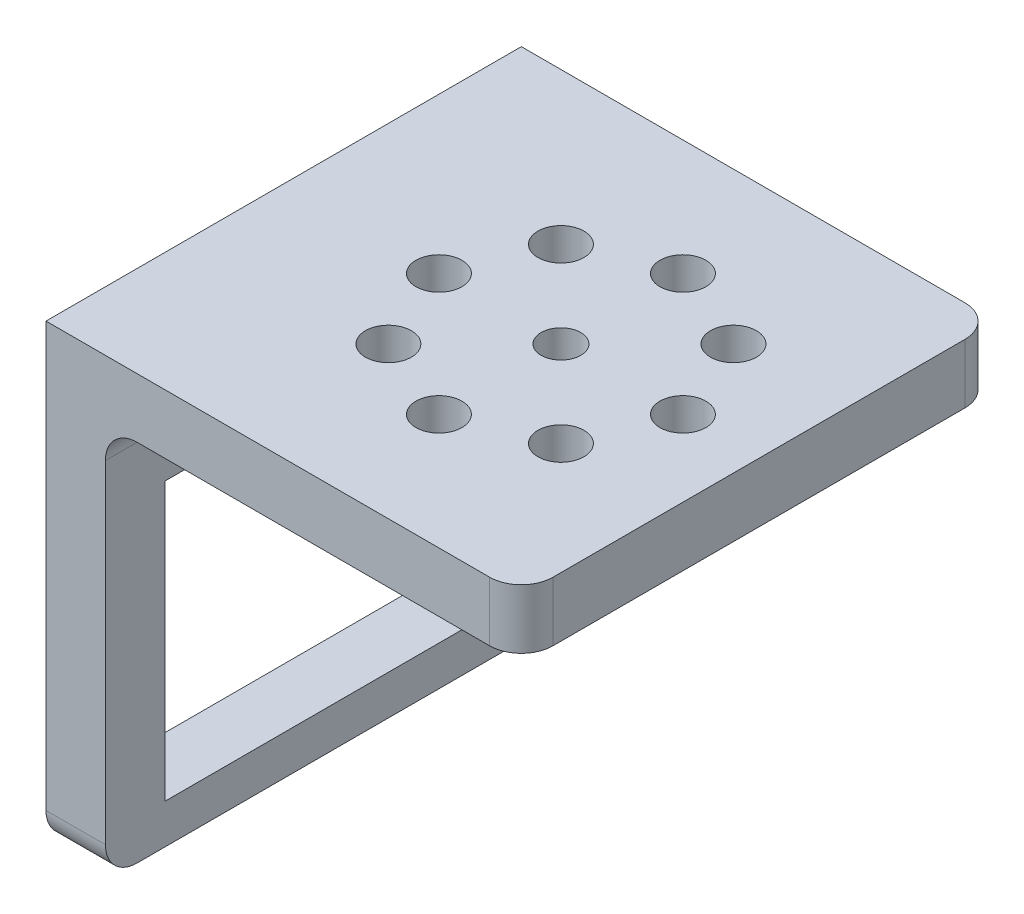
ISO-10303-21;
HEADER;
FILE_DESCRIPTION(('STEP AP214'),'2;1');
FILE_NAME('part.step','',(''),(''),'','','');
FILE_SCHEMA(('AUTOMOTIVE_DESIGN { 1 0 10303 214 1 1 1 1 }'));
ENDSEC;
DATA;
#1=APPLICATION_CONTEXT('core data for automotive mechanical design processes');
#2=APPLICATION_PROTOCOL_DEFINITION('international standard','automotive_design',2000,#1);
#3=PRODUCT_CONTEXT('',#1,'mechanical');
#4=PRODUCT('Part','Part','',(#3));
#5=PRODUCT_RELATED_PRODUCT_CATEGORY('part','',(#4));
#6=PRODUCT_DEFINITION_FORMATION('','',#4);
#7=PRODUCT_DEFINITION_CONTEXT('part definition',#1,'design');
#8=PRODUCT_DEFINITION('design','',#6,#7);
#9=PRODUCT_DEFINITION_SHAPE('','',#8);
#10=(LENGTH_UNIT() NAMED_UNIT(*) SI_UNIT(.MILLI.,.METRE.));
#11=(NAMED_UNIT(*) PLANE_ANGLE_UNIT() SI_UNIT($,.RADIAN.));
#12=(NAMED_UNIT(*) SI_UNIT($,.STERADIAN.) SOLID_ANGLE_UNIT());
#13=UNCERTAINTY_MEASURE_WITH_UNIT(LENGTH_MEASURE(1.E-05),#10,'distance_accuracy_value','');
#14=(GEOMETRIC_REPRESENTATION_CONTEXT(3) GLOBAL_UNCERTAINTY_ASSIGNED_CONTEXT((#13)) GLOBAL_UNIT_ASSIGNED_CONTEXT((#10,
#11,#12)) REPRESENTATION_CONTEXT('',''));
#15=CARTESIAN_POINT('',(0.,0.,0.));
#16=DIRECTION('',(0.,0.,1.));
#17=DIRECTION('',(1.,0.,0.));
#18=AXIS2_PLACEMENT_3D('',#15,#16,#17);
#19=CARTESIAN_POINT('',(-4.7625,0.,38.1));
#20=DIRECTION('',(0.,1.,0.));
#21=DIRECTION('',(0.,0.,1.));
#22=AXIS2_PLACEMENT_3D('',#19,#20,#21);
#23=PLANE('',#22);
#24=DIRECTION('',(0.,0.,-1.));
#25=VECTOR('',#24,1.);
#26=CARTESIAN_POINT('',(0.,0.,38.1));
#27=LINE('',#26,#25);
#28=CARTESIAN_POINT('',(0.,0.,35.56));
#29=VERTEX_POINT('',#28);
#30=CARTESIAN_POINT('',(0.,0.,2.54000000000001));
#31=VERTEX_POINT('',#30);
#32=EDGE_CURVE('E215',#29,#31,#27,.T.);
#33=ORIENTED_EDGE('',*,*,#32,.F.);
#34=DIRECTION('',(1.,0.,0.));
#35=VECTOR('',#34,1.);
#36=CARTESIAN_POINT('',(-4.7625,0.,35.56));
#37=LINE('',#36,#35);
#38=CARTESIAN_POINT('',(-4.7625,0.,35.56));
#39=VERTEX_POINT('',#38);
#40=EDGE_CURVE('E56',#29,#39,#37,.F.);
#41=ORIENTED_EDGE('',*,*,#40,.T.);
#42=DIRECTION('',(0.,0.,-1.));
#43=VECTOR('',#42,1.);
#44=CARTESIAN_POINT('',(-4.7625,0.,38.1));
#45=LINE('',#44,#43);
#46=CARTESIAN_POINT('',(-4.7625,0.,2.54000000000001));
#47=VERTEX_POINT('',#46);
#48=EDGE_CURVE('E197',#39,#47,#45,.T.);
#49=ORIENTED_EDGE('',*,*,#48,.T.);
#50=DIRECTION('',(1.,0.,0.));
#51=VECTOR('',#50,1.);
#52=CARTESIAN_POINT('',(-4.7625,0.,2.54));
#53=LINE('',#52,#51);
#54=EDGE_CURVE('E256',#47,#31,#53,.T.);
#55=ORIENTED_EDGE('',*,*,#54,.T.);
#56=EDGE_LOOP('',(#33,#41,#49,#55));
#57=FACE_BOUND('',#56,.T.);
#58=ADVANCED_FACE('F35',(#57),#23,.F.);
#59=CARTESIAN_POINT('',(0.,0.,38.1));
#60=DIRECTION('',(-1.,0.,0.));
#61=DIRECTION('',(0.,0.,1.));
#62=AXIS2_PLACEMENT_3D('',#59,#60,#61);
#63=PLANE('',#62);
#64=DIRECTION('',(0.,0.,-1.));
#65=VECTOR('',#64,1.);
#66=CARTESIAN_POINT('',(0.,25.4,38.1));
#67=LINE('',#66,#65);
#68=CARTESIAN_POINT('',(0.,25.4,33.3375));
#69=VERTEX_POINT('',#68);
#70=CARTESIAN_POINT('',(0.,25.4,4.7625));
#71=VERTEX_POINT('',#70);
#72=EDGE_CURVE('E179',#69,#71,#67,.T.);
#73=ORIENTED_EDGE('',*,*,#72,.T.);
#74=DIRECTION('',(0.,-1.,0.));
#75=VECTOR('',#74,1.);
#76=CARTESIAN_POINT('',(0.,0.,4.76250000000001));
#77=LINE('',#76,#75);
#78=CARTESIAN_POINT('',(0.,3.175,4.76250000000001));
#79=VERTEX_POINT('',#78);
#80=EDGE_CURVE('E182',#71,#79,#77,.T.);
#81=ORIENTED_EDGE('',*,*,#80,.T.);
#82=DIRECTION('',(0.,0.,1.));
#83=VECTOR('',#82,1.);
#84=CARTESIAN_POINT('',(0.,3.175,38.1));
#85=LINE('',#84,#83);
#86=CARTESIAN_POINT('',(0.,3.175,33.3375));
#87=VERTEX_POINT('',#86);
#88=EDGE_CURVE('E174',#79,#87,#85,.T.);
#89=ORIENTED_EDGE('',*,*,#88,.T.);
#90=DIRECTION('',(0.,1.,0.));
#91=VECTOR('',#90,1.);
#92=CARTESIAN_POINT('',(0.,0.,33.3375));
#93=LINE('',#92,#91);
#94=EDGE_CURVE('E150',#87,#69,#93,.T.);
#95=ORIENTED_EDGE('',*,*,#94,.T.);
#96=EDGE_LOOP('',(#73,#81,#89,#95));
#97=FACE_BOUND('',#96,.T.);
#98=DIRECTION('',(0.,1.,0.));
#99=VECTOR('',#98,1.);
#100=CARTESIAN_POINT('',(0.,0.,38.1));
#101=LINE('',#100,#99);
#102=CARTESIAN_POINT('',(0.,2.54,38.1));
#103=VERTEX_POINT('',#102);
#104=CARTESIAN_POINT('',(0.,29.21,38.1));
#105=VERTEX_POINT('',#104);
#106=EDGE_CURVE('E186',#103,#105,#101,.T.);
#107=ORIENTED_EDGE('',*,*,#106,.F.);
#108=CARTESIAN_POINT('',(0.,2.54,35.56));
#109=DIRECTION('',(-1.,0.,0.));
#110=DIRECTION('',(0.,0.,1.));
#111=AXIS2_PLACEMENT_3D('',#108,#109,#110);
#112=CIRCLE('',#111,2.54);
#113=EDGE_CURVE('E254',#103,#29,#112,.F.);
#114=ORIENTED_EDGE('',*,*,#113,.T.);
#115=ORIENTED_EDGE('',*,*,#32,.T.);
#116=CARTESIAN_POINT('',(0.,2.54,2.54));
#117=DIRECTION('',(-1.,0.,0.));
#118=DIRECTION('',(0.,0.,1.));
#119=AXIS2_PLACEMENT_3D('',#116,#117,#118);
#120=CIRCLE('',#119,2.54);
#121=CARTESIAN_POINT('',(0.,2.54,0.));
#122=VERTEX_POINT('',#121);
#123=EDGE_CURVE('E252',#31,#122,#120,.F.);
#124=ORIENTED_EDGE('',*,*,#123,.T.);
#125=DIRECTION('',(0.,1.,0.));
#126=VECTOR('',#125,1.);
#127=CARTESIAN_POINT('',(0.,0.,0.));
#128=LINE('',#127,#126);
#129=CARTESIAN_POINT('',(0.,29.21,0.));
#130=VERTEX_POINT('',#129);
#131=EDGE_CURVE('E185',#122,#130,#128,.T.);
#132=ORIENTED_EDGE('',*,*,#131,.T.);
#133=DIRECTION('',(0.,0.,-1.));
#134=VECTOR('',#133,1.);
#135=CARTESIAN_POINT('',(0.,29.21,38.1));
#136=LINE('',#135,#134);
#137=EDGE_CURVE('E221',#130,#105,#136,.F.);
#138=ORIENTED_EDGE('',*,*,#137,.T.);
#139=EDGE_LOOP('',(#107,#114,#115,#124,#132,#138));
#140=FACE_BOUND('',#139,.T.);
#141=ADVANCED_FACE('F263',(#97,#140),#63,.F.);
#142=CARTESIAN_POINT('',(0.,31.75,38.1));
#143=DIRECTION('',(0.,1.,0.));
#144=DIRECTION('',(0.,0.,1.));
#145=AXIS2_PLACEMENT_3D('',#142,#143,#144);
#146=PLANE('',#145);
#147=CARTESIAN_POINT('',(17.4625,31.75,9.271));
#148=DIRECTION('',(0.,1.,0.));
#149=DIRECTION('',(0.,0.,1.));
#150=AXIS2_PLACEMENT_3D('',#147,#148,#149);
#151=CIRCLE('',#150,1.8415);
#152=CARTESIAN_POINT('',(17.4625,31.75,11.1125));
#153=VERTEX_POINT('',#152);
#154=EDGE_CURVE('E344',#153,#153,#151,.T.);
#155=ORIENTED_EDGE('',*,*,#154,.T.);
#156=EDGE_LOOP('',(#155));
#157=FACE_BOUND('',#156,.T.);
#158=CARTESIAN_POINT('',(10.5477027867767,31.75,12.1352027867768));
#159=DIRECTION('',(0.,1.,0.));
#160=DIRECTION('',(0.,0.,1.));
#161=AXIS2_PLACEMENT_3D('',#158,#159,#160);
#162=CIRCLE('',#161,1.8415);
#163=CARTESIAN_POINT('',(10.5477027867767,31.75,13.9767027867768));
#164=VERTEX_POINT('',#163);
#165=EDGE_CURVE('E348',#164,#164,#162,.T.);
#166=ORIENTED_EDGE('',*,*,#165,.T.);
#167=EDGE_LOOP('',(#166));
#168=FACE_BOUND('',#167,.T.);
#169=CARTESIAN_POINT('',(7.6835,31.75,19.05));
#170=DIRECTION('',(0.,1.,0.));
#171=DIRECTION('',(0.,0.,1.));
#172=AXIS2_PLACEMENT_3D('',#169,#170,#171);
#173=CIRCLE('',#172,1.8415);
#174=CARTESIAN_POINT('',(7.6835,31.75,20.8915));
#175=VERTEX_POINT('',#174);
#176=EDGE_CURVE('E352',#175,#175,#173,.T.);
#177=ORIENTED_EDGE('',*,*,#176,.T.);
#178=EDGE_LOOP('',(#177));
#179=FACE_BOUND('',#178,.T.);
#180=CARTESIAN_POINT('',(10.5477027867768,31.75,25.9647972132233));
#181=DIRECTION('',(0.,1.,0.));
#182=DIRECTION('',(0.,0.,1.));
#183=AXIS2_PLACEMENT_3D('',#180,#181,#182);
#184=CIRCLE('',#183,1.8415);
#185=CARTESIAN_POINT('',(10.5477027867768,31.75,27.8062972132233));
#186=VERTEX_POINT('',#185);
#187=EDGE_CURVE('E356',#186,#186,#184,.T.);
#188=ORIENTED_EDGE('',*,*,#187,.T.);
#189=EDGE_LOOP('',(#188));
#190=FACE_BOUND('',#189,.T.);
#191=CARTESIAN_POINT('',(17.4625000000001,31.75,28.829));
#192=DIRECTION('',(0.,1.,0.));
#193=DIRECTION('',(0.,0.,1.));
#194=AXIS2_PLACEMENT_3D('',#191,#192,#193);
#195=CIRCLE('',#194,1.8415);
#196=CARTESIAN_POINT('',(17.4625000000001,31.75,30.6705));
#197=VERTEX_POINT('',#196);
#198=EDGE_CURVE('E360',#197,#197,#195,.T.);
#199=ORIENTED_EDGE('',*,*,#198,.T.);
#200=EDGE_LOOP('',(#199));
#201=FACE_BOUND('',#200,.T.);
#202=CARTESIAN_POINT('',(24.3772972132233,31.75,25.9647972132232));
#203=DIRECTION('',(0.,1.,0.));
#204=DIRECTION('',(0.,0.,1.));
#205=AXIS2_PLACEMENT_3D('',#202,#203,#204);
#206=CIRCLE('',#205,1.8415);
#207=CARTESIAN_POINT('',(24.3772972132233,31.75,27.8062972132232));
#208=VERTEX_POINT('',#207);
#209=EDGE_CURVE('E364',#208,#208,#206,.T.);
#210=ORIENTED_EDGE('',*,*,#209,.T.);
#211=EDGE_LOOP('',(#210));
#212=FACE_BOUND('',#211,.T.);
#213=CARTESIAN_POINT('',(24.3772972132232,31.75,12.1352027867767));
#214=DIRECTION('',(0.,1.,0.));
#215=DIRECTION('',(0.,0.,1.));
#216=AXIS2_PLACEMENT_3D('',#213,#214,#215);
#217=CIRCLE('',#216,1.8415);
#218=CARTESIAN_POINT('',(24.3772972132232,31.75,13.9767027867767));
#219=VERTEX_POINT('',#218);
#220=EDGE_CURVE('E368',#219,#219,#217,.T.);
#221=ORIENTED_EDGE('',*,*,#220,.T.);
#222=EDGE_LOOP('',(#221));
#223=FACE_BOUND('',#222,.T.);
#224=CARTESIAN_POINT('',(27.2415,31.75,19.05));
#225=DIRECTION('',(0.,1.,0.));
#226=DIRECTION('',(0.,0.,1.));
#227=AXIS2_PLACEMENT_3D('',#224,#225,#226);
#228=CIRCLE('',#227,1.8415);
#229=CARTESIAN_POINT('',(27.2415,31.75,20.8915));
#230=VERTEX_POINT('',#229);
#231=EDGE_CURVE('E372',#230,#230,#228,.T.);
#232=ORIENTED_EDGE('',*,*,#231,.T.);
#233=EDGE_LOOP('',(#232));
#234=FACE_BOUND('',#233,.T.);
#235=CARTESIAN_POINT('',(17.4625,31.75,19.05));
#236=DIRECTION('',(0.,1.,0.));
#237=DIRECTION('',(0.,0.,1.));
#238=AXIS2_PLACEMENT_3D('',#235,#236,#237);
#239=CIRCLE('',#238,1.5875);
#240=CARTESIAN_POINT('',(17.4625,31.75,20.6375));
#241=VERTEX_POINT('',#240);
#242=EDGE_CURVE('E375',#241,#241,#239,.T.);
#243=ORIENTED_EDGE('',*,*,#242,.T.);
#244=EDGE_LOOP('',(#243));
#245=FACE_BOUND('',#244,.T.);
#246=DIRECTION('',(1.,0.,0.));
#247=VECTOR('',#246,1.);
#248=CARTESIAN_POINT('',(0.,31.75,0.));
#249=LINE('',#248,#247);
#250=CARTESIAN_POINT('',(2.54,31.75,0.));
#251=VERTEX_POINT('',#250);
#252=CARTESIAN_POINT('',(30.7975,31.75,0.));
#253=VERTEX_POINT('',#252);
#254=EDGE_CURVE('E199',#251,#253,#249,.T.);
#255=ORIENTED_EDGE('',*,*,#254,.T.);
#256=CARTESIAN_POINT('',(30.7975,31.75,2.54));
#257=DIRECTION('',(0.,1.,0.));
#258=DIRECTION('',(0.,0.,1.));
#259=AXIS2_PLACEMENT_3D('',#256,#257,#258);
#260=CIRCLE('',#259,2.54);
#261=CARTESIAN_POINT('',(33.3375,31.75,2.54000000000001));
#262=VERTEX_POINT('',#261);
#263=EDGE_CURVE('E244',#253,#262,#260,.F.);
#264=ORIENTED_EDGE('',*,*,#263,.T.);
#265=DIRECTION('',(0.,0.,-1.));
#266=VECTOR('',#265,1.);
#267=CARTESIAN_POINT('',(33.3375,31.75,38.1));
#268=LINE('',#267,#266);
#269=CARTESIAN_POINT('',(33.3375,31.75,35.56));
#270=VERTEX_POINT('',#269);
#271=EDGE_CURVE('E212',#270,#262,#268,.T.);
#272=ORIENTED_EDGE('',*,*,#271,.F.);
#273=CARTESIAN_POINT('',(30.7975,31.75,35.56));
#274=DIRECTION('',(0.,1.,0.));
#275=DIRECTION('',(0.,0.,1.));
#276=AXIS2_PLACEMENT_3D('',#273,#274,#275);
#277=CIRCLE('',#276,2.54);
#278=CARTESIAN_POINT('',(30.7975,31.75,38.1));
#279=VERTEX_POINT('',#278);
#280=EDGE_CURVE('E242',#270,#279,#277,.F.);
#281=ORIENTED_EDGE('',*,*,#280,.T.);
#282=DIRECTION('',(1.,0.,0.));
#283=VECTOR('',#282,1.);
#284=CARTESIAN_POINT('',(0.,31.75,38.1));
#285=LINE('',#284,#283);
#286=CARTESIAN_POINT('',(2.54,31.75,38.1));
#287=VERTEX_POINT('',#286);
#288=EDGE_CURVE('E188',#287,#279,#285,.T.);
#289=ORIENTED_EDGE('',*,*,#288,.F.);
#290=DIRECTION('',(0.,0.,-1.));
#291=VECTOR('',#290,1.);
#292=CARTESIAN_POINT('',(2.54,31.75,0.));
#293=LINE('',#292,#291);
#294=EDGE_CURVE('E218',#287,#251,#293,.T.);
#295=ORIENTED_EDGE('',*,*,#294,.T.);
#296=EDGE_LOOP('',(#255,#264,#272,#281,#289,#295));
#297=FACE_BOUND('',#296,.T.);
#298=ADVANCED_FACE('F291',(#157,#168,#179,#190,#201,#212,#223,#234,#245,#297),#146,.F.);
#299=CARTESIAN_POINT('',(33.3375,31.75,38.1));
#300=DIRECTION('',(-1.,0.,0.));
#301=DIRECTION('',(0.,0.,1.));
#302=AXIS2_PLACEMENT_3D('',#299,#300,#301);
#303=PLANE('',#302);
#304=ORIENTED_EDGE('',*,*,#271,.T.);
#305=DIRECTION('',(0.,1.,0.));
#306=VECTOR('',#305,1.);
#307=CARTESIAN_POINT('',(33.3375,31.75,2.54));
#308=LINE('',#307,#306);
#309=CARTESIAN_POINT('',(33.3375,36.5125,2.54000000000001));
#310=VERTEX_POINT('',#309);
#311=EDGE_CURVE('E231',#262,#310,#308,.T.);
#312=ORIENTED_EDGE('',*,*,#311,.T.);
#313=DIRECTION('',(0.,0.,-1.));
#314=VECTOR('',#313,1.);
#315=CARTESIAN_POINT('',(33.3375,36.5125,38.1));
#316=LINE('',#315,#314);
#317=CARTESIAN_POINT('',(33.3375,36.5125,35.56));
#318=VERTEX_POINT('',#317);
#319=EDGE_CURVE('E209',#318,#310,#316,.T.);
#320=ORIENTED_EDGE('',*,*,#319,.F.);
#321=DIRECTION('',(0.,1.,0.));
#322=VECTOR('',#321,1.);
#323=CARTESIAN_POINT('',(33.3375,31.75,35.56));
#324=LINE('',#323,#322);
#325=EDGE_CURVE('E229',#318,#270,#324,.F.);
#326=ORIENTED_EDGE('',*,*,#325,.T.);
#327=EDGE_LOOP('',(#304,#312,#320,#326));
#328=FACE_BOUND('',#327,.T.);
#329=ADVANCED_FACE('F322',(#328),#303,.F.);
#330=CARTESIAN_POINT('',(33.3375,36.5125,38.1));
#331=DIRECTION('',(0.,-1.,0.));
#332=DIRECTION('',(1.,0.,0.));
#333=AXIS2_PLACEMENT_3D('',#330,#331,#332);
#334=PLANE('',#333);
#335=CARTESIAN_POINT('',(17.4625,36.5125,9.271));
#336=DIRECTION('',(0.,1.,0.));
#337=DIRECTION('',(0.,0.,1.));
#338=AXIS2_PLACEMENT_3D('',#335,#336,#337);
#339=CIRCLE('',#338,1.8415);
#340=CARTESIAN_POINT('',(17.4625,36.5125,11.1125));
#341=VERTEX_POINT('',#340);
#342=EDGE_CURVE('E396',#341,#341,#339,.T.);
#343=ORIENTED_EDGE('',*,*,#342,.F.);
#344=EDGE_LOOP('',(#343));
#345=FACE_BOUND('',#344,.T.);
#346=CARTESIAN_POINT('',(10.5477027867767,36.5125,12.1352027867768));
#347=DIRECTION('',(0.,1.,0.));
#348=DIRECTION('',(0.707106781186551,0.,0.707106781186544));
#349=AXIS2_PLACEMENT_3D('',#346,#347,#348);
#350=CIRCLE('',#349,1.8415);
#351=CARTESIAN_POINT('',(11.8498399243317,36.5125,13.4373399243318));
#352=VERTEX_POINT('',#351);
#353=EDGE_CURVE('E404',#352,#352,#350,.T.);
#354=ORIENTED_EDGE('',*,*,#353,.F.);
#355=EDGE_LOOP('',(#354));
#356=FACE_BOUND('',#355,.T.);
#357=CARTESIAN_POINT('',(7.6835,36.5125,19.05));
#358=DIRECTION('',(0.,1.,0.));
#359=DIRECTION('',(1.,0.,0.));
#360=AXIS2_PLACEMENT_3D('',#357,#358,#359);
#361=CIRCLE('',#360,1.8415);
#362=CARTESIAN_POINT('',(9.525,36.5125,19.05));
#363=VERTEX_POINT('',#362);
#364=EDGE_CURVE('E400',#363,#363,#361,.T.);
#365=ORIENTED_EDGE('',*,*,#364,.F.);
#366=EDGE_LOOP('',(#365));
#367=FACE_BOUND('',#366,.T.);
#368=CARTESIAN_POINT('',(10.5477027867768,36.5125,25.9647972132233));
#369=DIRECTION('',(0.,1.,0.));
#370=DIRECTION('',(0.707106781186541,0.,-0.707106781186554));
#371=AXIS2_PLACEMENT_3D('',#368,#369,#370);
#372=CIRCLE('',#371,1.8415);
#373=CARTESIAN_POINT('',(11.8498399243318,36.5125,24.6626600756683));
#374=VERTEX_POINT('',#373);
#375=EDGE_CURVE('E397',#374,#374,#372,.T.);
#376=ORIENTED_EDGE('',*,*,#375,.F.);
#377=EDGE_LOOP('',(#376));
#378=FACE_BOUND('',#377,.T.);
#379=CARTESIAN_POINT('',(17.4625000000001,36.5125,28.829));
#380=DIRECTION('',(0.,1.,0.));
#381=DIRECTION('',(0.,0.,-1.));
#382=AXIS2_PLACEMENT_3D('',#379,#380,#381);
#383=CIRCLE('',#382,1.8415);
#384=CARTESIAN_POINT('',(17.4625000000001,36.5125,26.9875));
#385=VERTEX_POINT('',#384);
#386=EDGE_CURVE('E401',#385,#385,#383,.T.);
#387=ORIENTED_EDGE('',*,*,#386,.F.);
#388=EDGE_LOOP('',(#387));
#389=FACE_BOUND('',#388,.T.);
#390=CARTESIAN_POINT('',(24.3772972132233,36.5125,25.9647972132232));
#391=DIRECTION('',(0.,1.,0.));
#392=DIRECTION('',(-0.707106781186556,0.,-0.707106781186539));
#393=AXIS2_PLACEMENT_3D('',#390,#391,#392);
#394=CIRCLE('',#393,1.8415);
#395=CARTESIAN_POINT('',(23.0751600756683,36.5125,24.6626600756682));
#396=VERTEX_POINT('',#395);
#397=EDGE_CURVE('E409',#396,#396,#394,.T.);
#398=ORIENTED_EDGE('',*,*,#397,.F.);
#399=EDGE_LOOP('',(#398));
#400=FACE_BOUND('',#399,.T.);
#401=CARTESIAN_POINT('',(24.3772972132232,36.5125,12.1352027867767));
#402=DIRECTION('',(0.,1.,0.));
#403=DIRECTION('',(-0.707106781186546,0.,0.707106781186549));
#404=AXIS2_PLACEMENT_3D('',#401,#402,#403);
#405=CIRCLE('',#404,1.8415);
#406=CARTESIAN_POINT('',(23.0751600756682,36.5125,13.4373399243318));
#407=VERTEX_POINT('',#406);
#408=EDGE_CURVE('E393',#407,#407,#405,.T.);
#409=ORIENTED_EDGE('',*,*,#408,.F.);
#410=EDGE_LOOP('',(#409));
#411=FACE_BOUND('',#410,.T.);
#412=CARTESIAN_POINT('',(27.2415,36.5125,19.05));
#413=DIRECTION('',(0.,1.,0.));
#414=DIRECTION('',(-1.,0.,0.));
#415=AXIS2_PLACEMENT_3D('',#412,#413,#414);
#416=CIRCLE('',#415,1.8415);
#417=CARTESIAN_POINT('',(25.4,36.5125,19.05));
#418=VERTEX_POINT('',#417);
#419=EDGE_CURVE('E383',#418,#418,#416,.T.);
#420=ORIENTED_EDGE('',*,*,#419,.F.);
#421=EDGE_LOOP('',(#420));
#422=FACE_BOUND('',#421,.T.);
#423=CARTESIAN_POINT('',(17.4625,36.5125,19.05));
#424=DIRECTION('',(0.,1.,0.));
#425=DIRECTION('',(-1.,0.,0.));
#426=AXIS2_PLACEMENT_3D('',#423,#424,#425);
#427=CIRCLE('',#426,1.5875);
#428=CARTESIAN_POINT('',(15.875,36.5125,19.05));
#429=VERTEX_POINT('',#428);
#430=EDGE_CURVE('E377',#429,#429,#427,.T.);
#431=ORIENTED_EDGE('',*,*,#430,.F.);
#432=EDGE_LOOP('',(#431));
#433=FACE_BOUND('',#432,.T.);
#434=ORIENTED_EDGE('',*,*,#319,.T.);
#435=CARTESIAN_POINT('',(30.7975,36.5125,2.54));
#436=DIRECTION('',(0.,-1.,0.));
#437=DIRECTION('',(1.,0.,0.));
#438=AXIS2_PLACEMENT_3D('',#435,#436,#437);
#439=CIRCLE('',#438,2.54);
#440=CARTESIAN_POINT('',(30.7975,36.5125,0.));
#441=VERTEX_POINT('',#440);
#442=EDGE_CURVE('E236',#310,#441,#439,.F.);
#443=ORIENTED_EDGE('',*,*,#442,.T.);
#444=DIRECTION('',(-1.,0.,0.));
#445=VECTOR('',#444,1.);
#446=CARTESIAN_POINT('',(33.3375,36.5125,0.));
#447=LINE('',#446,#445);
#448=CARTESIAN_POINT('',(-4.7625,36.5125,0.));
#449=VERTEX_POINT('',#448);
#450=EDGE_CURVE('E202',#441,#449,#447,.T.);
#451=ORIENTED_EDGE('',*,*,#450,.T.);
#452=DIRECTION('',(0.,0.,-1.));
#453=VECTOR('',#452,1.);
#454=CARTESIAN_POINT('',(-4.7625,36.5125,38.1));
#455=LINE('',#454,#453);
#456=CARTESIAN_POINT('',(-4.7625,36.5125,38.1));
#457=VERTEX_POINT('',#456);
#458=EDGE_CURVE('E206',#457,#449,#455,.T.);
#459=ORIENTED_EDGE('',*,*,#458,.F.);
#460=DIRECTION('',(-1.,0.,0.));
#461=VECTOR('',#460,1.);
#462=CARTESIAN_POINT('',(33.3375,36.5125,38.1));
#463=LINE('',#462,#461);
#464=CARTESIAN_POINT('',(30.7975,36.5125,38.1));
#465=VERTEX_POINT('',#464);
#466=EDGE_CURVE('E192',#465,#457,#463,.T.);
#467=ORIENTED_EDGE('',*,*,#466,.F.);
#468=CARTESIAN_POINT('',(30.7975,36.5125,35.56));
#469=DIRECTION('',(0.,-1.,0.));
#470=DIRECTION('',(1.,0.,0.));
#471=AXIS2_PLACEMENT_3D('',#468,#469,#470);
#472=CIRCLE('',#471,2.54);
#473=EDGE_CURVE('E234',#465,#318,#472,.F.);
#474=ORIENTED_EDGE('',*,*,#473,.T.);
#475=EDGE_LOOP('',(#434,#443,#451,#459,#467,#474));
#476=FACE_BOUND('',#475,.T.);
#477=ADVANCED_FACE('F324',(#345,#356,#367,#378,#389,#400,#411,#422,#433,#476),#334,.F.);
#478=CARTESIAN_POINT('',(-4.7625,36.5125,38.1));
#479=DIRECTION('',(1.,0.,0.));
#480=DIRECTION('',(0.,1.,0.));
#481=AXIS2_PLACEMENT_3D('',#478,#479,#480);
#482=PLANE('',#481);
#483=DIRECTION('',(0.,0.,1.));
#484=VECTOR('',#483,1.);
#485=CARTESIAN_POINT('',(-4.7625,3.175,4.76250000000001));
#486=LINE('',#485,#484);
#487=CARTESIAN_POINT('',(-4.7625,3.175,4.76250000000001));
#488=VERTEX_POINT('',#487);
#489=CARTESIAN_POINT('',(-4.7625,3.175,33.3375));
#490=VERTEX_POINT('',#489);
#491=EDGE_CURVE('E158',#488,#490,#486,.T.);
#492=ORIENTED_EDGE('',*,*,#491,.F.);
#493=DIRECTION('',(0.,-1.,0.));
#494=VECTOR('',#493,1.);
#495=CARTESIAN_POINT('',(-4.7625,25.4,4.7625));
#496=LINE('',#495,#494);
#497=CARTESIAN_POINT('',(-4.7625,25.4,4.7625));
#498=VERTEX_POINT('',#497);
#499=EDGE_CURVE('E163',#498,#488,#496,.T.);
#500=ORIENTED_EDGE('',*,*,#499,.F.);
#501=DIRECTION('',(0.,0.,-1.));
#502=VECTOR('',#501,1.);
#503=CARTESIAN_POINT('',(-4.7625,25.4,4.7625));
#504=LINE('',#503,#502);
#505=CARTESIAN_POINT('',(-4.7625,25.4,33.3375));
#506=VERTEX_POINT('',#505);
#507=EDGE_CURVE('E167',#506,#498,#504,.T.);
#508=ORIENTED_EDGE('',*,*,#507,.F.);
#509=DIRECTION('',(0.,1.,0.));
#510=VECTOR('',#509,1.);
#511=CARTESIAN_POINT('',(-4.7625,25.4,33.3375));
#512=LINE('',#511,#510);
#513=EDGE_CURVE('E147',#490,#506,#512,.T.);
#514=ORIENTED_EDGE('',*,*,#513,.F.);
#515=EDGE_LOOP('',(#492,#500,#508,#514));
#516=FACE_BOUND('',#515,.T.);
#517=ORIENTED_EDGE('',*,*,#48,.F.);
#518=CARTESIAN_POINT('',(-4.7625,2.54,35.56));
#519=DIRECTION('',(1.,0.,0.));
#520=DIRECTION('',(0.,1.,0.));
#521=AXIS2_PLACEMENT_3D('',#518,#519,#520);
#522=CIRCLE('',#521,2.54);
#523=CARTESIAN_POINT('',(-4.7625,2.54,38.1));
#524=VERTEX_POINT('',#523);
#525=EDGE_CURVE('E11',#39,#524,#522,.F.);
#526=ORIENTED_EDGE('',*,*,#525,.T.);
#527=DIRECTION('',(0.,-1.,0.));
#528=VECTOR('',#527,1.);
#529=CARTESIAN_POINT('',(-4.7625,36.5125,38.1));
#530=LINE('',#529,#528);
#531=EDGE_CURVE('E194',#457,#524,#530,.T.);
#532=ORIENTED_EDGE('',*,*,#531,.F.);
#533=ORIENTED_EDGE('',*,*,#458,.T.);
#534=DIRECTION('',(0.,-1.,0.));
#535=VECTOR('',#534,1.);
#536=CARTESIAN_POINT('',(-4.7625,36.5125,0.));
#537=LINE('',#536,#535);
#538=CARTESIAN_POINT('',(-4.7625,2.54,0.));
#539=VERTEX_POINT('',#538);
#540=EDGE_CURVE('E189',#449,#539,#537,.T.);
#541=ORIENTED_EDGE('',*,*,#540,.T.);
#542=CARTESIAN_POINT('',(-4.7625,2.54,2.54));
#543=DIRECTION('',(1.,0.,0.));
#544=DIRECTION('',(0.,1.,0.));
#545=AXIS2_PLACEMENT_3D('',#542,#543,#544);
#546=CIRCLE('',#545,2.54);
#547=EDGE_CURVE('E43',#539,#47,#546,.F.);
#548=ORIENTED_EDGE('',*,*,#547,.T.);
#549=EDGE_LOOP('',(#517,#526,#532,#533,#541,#548));
#550=FACE_BOUND('',#549,.T.);
#551=ADVANCED_FACE('F165',(#516,#550),#482,.F.);
#552=CARTESIAN_POINT('',(0.,0.,38.1));
#553=DIRECTION('',(0.,0.,1.));
#554=DIRECTION('',(1.,0.,0.));
#555=AXIS2_PLACEMENT_3D('',#552,#553,#554);
#556=PLANE('',#555);
#557=ORIENTED_EDGE('',*,*,#288,.T.);
#558=DIRECTION('',(0.,1.,0.));
#559=VECTOR('',#558,1.);
#560=CARTESIAN_POINT('',(30.7975,36.5125,38.1));
#561=LINE('',#560,#559);
#562=EDGE_CURVE('E249',#279,#465,#561,.T.);
#563=ORIENTED_EDGE('',*,*,#562,.T.);
#564=ORIENTED_EDGE('',*,*,#466,.T.);
#565=ORIENTED_EDGE('',*,*,#531,.T.);
#566=DIRECTION('',(1.,0.,0.));
#567=VECTOR('',#566,1.);
#568=CARTESIAN_POINT('',(0.,2.54,38.1));
#569=LINE('',#568,#567);
#570=EDGE_CURVE('E246',#524,#103,#569,.T.);
#571=ORIENTED_EDGE('',*,*,#570,.T.);
#572=ORIENTED_EDGE('',*,*,#106,.T.);
#573=CARTESIAN_POINT('',(2.54,29.21,38.1));
#574=DIRECTION('',(0.,0.,1.));
#575=DIRECTION('',(1.,0.,0.));
#576=AXIS2_PLACEMENT_3D('',#573,#574,#575);
#577=CIRCLE('',#576,2.54);
#578=EDGE_CURVE('E227',#105,#287,#577,.F.);
#579=ORIENTED_EDGE('',*,*,#578,.T.);
#580=EDGE_LOOP('',(#557,#563,#564,#565,#571,#572,#579));
#581=FACE_BOUND('',#580,.T.);
#582=ADVANCED_FACE('F270',(#581),#556,.T.);
#583=CARTESIAN_POINT('',(0.,0.,0.));
#584=DIRECTION('',(0.,0.,1.));
#585=DIRECTION('',(1.,0.,0.));
#586=AXIS2_PLACEMENT_3D('',#583,#584,#585);
#587=PLANE('',#586);
#588=ORIENTED_EDGE('',*,*,#450,.F.);
#589=DIRECTION('',(0.,1.,0.));
#590=VECTOR('',#589,1.);
#591=CARTESIAN_POINT('',(30.7975,0.,0.));
#592=LINE('',#591,#590);
#593=EDGE_CURVE('E240',#441,#253,#592,.F.);
#594=ORIENTED_EDGE('',*,*,#593,.T.);
#595=ORIENTED_EDGE('',*,*,#254,.F.);
#596=CARTESIAN_POINT('',(2.54,29.21,0.));
#597=DIRECTION('',(0.,0.,1.));
#598=DIRECTION('',(1.,0.,0.));
#599=AXIS2_PLACEMENT_3D('',#596,#597,#598);
#600=CIRCLE('',#599,2.54);
#601=EDGE_CURVE('E224',#251,#130,#600,.T.);
#602=ORIENTED_EDGE('',*,*,#601,.T.);
#603=ORIENTED_EDGE('',*,*,#131,.F.);
#604=DIRECTION('',(1.,0.,0.));
#605=VECTOR('',#604,1.);
#606=CARTESIAN_POINT('',(0.,2.54,0.));
#607=LINE('',#606,#605);
#608=EDGE_CURVE('E238',#122,#539,#607,.F.);
#609=ORIENTED_EDGE('',*,*,#608,.T.);
#610=ORIENTED_EDGE('',*,*,#540,.F.);
#611=EDGE_LOOP('',(#588,#594,#595,#602,#603,#609,#610));
#612=FACE_BOUND('',#611,.T.);
#613=ADVANCED_FACE('F278',(#612),#587,.F.);
#614=CARTESIAN_POINT('',(33.3375,25.4,4.7625));
#615=DIRECTION('',(0.,0.,-1.));
#616=DIRECTION('',(0.,1.,0.));
#617=AXIS2_PLACEMENT_3D('',#614,#615,#616);
#618=PLANE('',#617);
#619=DIRECTION('',(-1.,0.,0.));
#620=VECTOR('',#619,1.);
#621=CARTESIAN_POINT('',(33.3375,25.4,4.7625));
#622=LINE('',#621,#620);
#623=EDGE_CURVE('E172',#71,#498,#622,.T.);
#624=ORIENTED_EDGE('',*,*,#623,.T.);
#625=ORIENTED_EDGE('',*,*,#499,.T.);
#626=DIRECTION('',(-1.,0.,0.));
#627=VECTOR('',#626,1.);
#628=CARTESIAN_POINT('',(33.3375,3.175,4.76250000000001));
#629=LINE('',#628,#627);
#630=EDGE_CURVE('E154',#79,#488,#629,.T.);
#631=ORIENTED_EDGE('',*,*,#630,.F.);
#632=ORIENTED_EDGE('',*,*,#80,.F.);
#633=EDGE_LOOP('',(#624,#625,#631,#632));
#634=FACE_BOUND('',#633,.T.);
#635=ADVANCED_FACE('F444',(#634),#618,.F.);
#636=CARTESIAN_POINT('',(33.3375,25.4,4.7625));
#637=DIRECTION('',(0.,1.,0.));
#638=DIRECTION('',(-1.,0.,0.));
#639=AXIS2_PLACEMENT_3D('',#636,#637,#638);
#640=PLANE('',#639);
#641=DIRECTION('',(-1.,0.,0.));
#642=VECTOR('',#641,1.);
#643=CARTESIAN_POINT('',(33.3375,25.4,33.3375));
#644=LINE('',#643,#642);
#645=EDGE_CURVE('E153',#69,#506,#644,.T.);
#646=ORIENTED_EDGE('',*,*,#645,.T.);
#647=ORIENTED_EDGE('',*,*,#507,.T.);
#648=ORIENTED_EDGE('',*,*,#623,.F.);
#649=ORIENTED_EDGE('',*,*,#72,.F.);
#650=EDGE_LOOP('',(#646,#647,#648,#649));
#651=FACE_BOUND('',#650,.T.);
#652=ADVANCED_FACE('F441',(#651),#640,.F.);
#653=CARTESIAN_POINT('',(33.3375,25.4,33.3375));
#654=DIRECTION('',(0.,0.,1.));
#655=DIRECTION('',(0.,-1.,0.));
#656=AXIS2_PLACEMENT_3D('',#653,#654,#655);
#657=PLANE('',#656);
#658=DIRECTION('',(-1.,0.,0.));
#659=VECTOR('',#658,1.);
#660=CARTESIAN_POINT('',(33.3375,3.175,33.3375));
#661=LINE('',#660,#659);
#662=EDGE_CURVE('E142',#87,#490,#661,.T.);
#663=ORIENTED_EDGE('',*,*,#662,.T.);
#664=ORIENTED_EDGE('',*,*,#513,.T.);
#665=ORIENTED_EDGE('',*,*,#645,.F.);
#666=ORIENTED_EDGE('',*,*,#94,.F.);
#667=EDGE_LOOP('',(#663,#664,#665,#666));
#668=FACE_BOUND('',#667,.T.);
#669=ADVANCED_FACE('F144',(#668),#657,.F.);
#670=CARTESIAN_POINT('',(33.3375,3.175,4.76250000000001));
#671=DIRECTION('',(0.,-1.,0.));
#672=DIRECTION('',(1.,0.,0.));
#673=AXIS2_PLACEMENT_3D('',#670,#671,#672);
#674=PLANE('',#673);
#675=ORIENTED_EDGE('',*,*,#630,.T.);
#676=ORIENTED_EDGE('',*,*,#491,.T.);
#677=ORIENTED_EDGE('',*,*,#662,.F.);
#678=ORIENTED_EDGE('',*,*,#88,.F.);
#679=EDGE_LOOP('',(#675,#676,#677,#678));
#680=FACE_BOUND('',#679,.T.);
#681=ADVANCED_FACE('F159',(#680),#674,.F.);
#682=CARTESIAN_POINT('',(17.4625,0.,19.05));
#683=DIRECTION('',(0.,1.,0.));
#684=DIRECTION('',(-1.,0.,0.));
#685=AXIS2_PLACEMENT_3D('',#682,#683,#684);
#686=CYLINDRICAL_SURFACE('',#685,1.5875);
#687=ORIENTED_EDGE('',*,*,#430,.T.);
#688=EDGE_LOOP('',(#687));
#689=FACE_BOUND('',#688,.T.);
#690=ORIENTED_EDGE('',*,*,#242,.F.);
#691=EDGE_LOOP('',(#690));
#692=FACE_BOUND('',#691,.T.);
#693=ADVANCED_FACE('F427',(#689,#692),#686,.F.);
#694=CARTESIAN_POINT('',(27.2415,0.,19.05));
#695=DIRECTION('',(0.,1.,0.));
#696=DIRECTION('',(-1.,0.,0.));
#697=AXIS2_PLACEMENT_3D('',#694,#695,#696);
#698=CYLINDRICAL_SURFACE('',#697,1.8415);
#699=ORIENTED_EDGE('',*,*,#419,.T.);
#700=EDGE_LOOP('',(#699));
#701=FACE_BOUND('',#700,.T.);
#702=ORIENTED_EDGE('',*,*,#231,.F.);
#703=EDGE_LOOP('',(#702));
#704=FACE_BOUND('',#703,.T.);
#705=ADVANCED_FACE('F429',(#701,#704),#698,.F.);
#706=CARTESIAN_POINT('',(24.3772972132232,0.,12.1352027867767));
#707=DIRECTION('',(0.,1.,0.));
#708=DIRECTION('',(-1.,0.,0.));
#709=AXIS2_PLACEMENT_3D('',#706,#707,#708);
#710=CYLINDRICAL_SURFACE('',#709,1.8415);
#711=ORIENTED_EDGE('',*,*,#408,.T.);
#712=EDGE_LOOP('',(#711));
#713=FACE_BOUND('',#712,.T.);
#714=ORIENTED_EDGE('',*,*,#220,.F.);
#715=EDGE_LOOP('',(#714));
#716=FACE_BOUND('',#715,.T.);
#717=ADVANCED_FACE('F435',(#713,#716),#710,.F.);
#718=CARTESIAN_POINT('',(24.3772972132233,0.,25.9647972132232));
#719=DIRECTION('',(0.,1.,0.));
#720=DIRECTION('',(-1.,0.,0.));
#721=AXIS2_PLACEMENT_3D('',#718,#719,#720);
#722=CYLINDRICAL_SURFACE('',#721,1.8415);
#723=ORIENTED_EDGE('',*,*,#397,.T.);
#724=EDGE_LOOP('',(#723));
#725=FACE_BOUND('',#724,.T.);
#726=ORIENTED_EDGE('',*,*,#209,.F.);
#727=EDGE_LOOP('',(#726));
#728=FACE_BOUND('',#727,.T.);
#729=ADVANCED_FACE('F493',(#725,#728),#722,.F.);
#730=CARTESIAN_POINT('',(17.4625000000001,0.,28.829));
#731=DIRECTION('',(0.,1.,0.));
#732=DIRECTION('',(-1.,0.,0.));
#733=AXIS2_PLACEMENT_3D('',#730,#731,#732);
#734=CYLINDRICAL_SURFACE('',#733,1.8415);
#735=ORIENTED_EDGE('',*,*,#386,.T.);
#736=EDGE_LOOP('',(#735));
#737=FACE_BOUND('',#736,.T.);
#738=ORIENTED_EDGE('',*,*,#198,.F.);
#739=EDGE_LOOP('',(#738));
#740=FACE_BOUND('',#739,.T.);
#741=ADVANCED_FACE('F415',(#737,#740),#734,.F.);
#742=CARTESIAN_POINT('',(10.5477027867768,0.,25.9647972132233));
#743=DIRECTION('',(0.,1.,0.));
#744=DIRECTION('',(-1.,0.,0.));
#745=AXIS2_PLACEMENT_3D('',#742,#743,#744);
#746=CYLINDRICAL_SURFACE('',#745,1.8415);
#747=ORIENTED_EDGE('',*,*,#375,.T.);
#748=EDGE_LOOP('',(#747));
#749=FACE_BOUND('',#748,.T.);
#750=ORIENTED_EDGE('',*,*,#187,.F.);
#751=EDGE_LOOP('',(#750));
#752=FACE_BOUND('',#751,.T.);
#753=ADVANCED_FACE('F511',(#749,#752),#746,.F.);
#754=CARTESIAN_POINT('',(7.68350000000001,0.,19.05));
#755=DIRECTION('',(0.,1.,0.));
#756=DIRECTION('',(-1.,0.,0.));
#757=AXIS2_PLACEMENT_3D('',#754,#755,#756);
#758=CYLINDRICAL_SURFACE('',#757,1.8415);
#759=ORIENTED_EDGE('',*,*,#364,.T.);
#760=EDGE_LOOP('',(#759));
#761=FACE_BOUND('',#760,.T.);
#762=ORIENTED_EDGE('',*,*,#176,.F.);
#763=EDGE_LOOP('',(#762));
#764=FACE_BOUND('',#763,.T.);
#765=ADVANCED_FACE('F520',(#761,#764),#758,.F.);
#766=CARTESIAN_POINT('',(10.5477027867767,0.,12.1352027867768));
#767=DIRECTION('',(0.,1.,0.));
#768=DIRECTION('',(-1.,0.,0.));
#769=AXIS2_PLACEMENT_3D('',#766,#767,#768);
#770=CYLINDRICAL_SURFACE('',#769,1.8415);
#771=ORIENTED_EDGE('',*,*,#353,.T.);
#772=EDGE_LOOP('',(#771));
#773=FACE_BOUND('',#772,.T.);
#774=ORIENTED_EDGE('',*,*,#165,.F.);
#775=EDGE_LOOP('',(#774));
#776=FACE_BOUND('',#775,.T.);
#777=ADVANCED_FACE('F530',(#773,#776),#770,.F.);
#778=CARTESIAN_POINT('',(17.4625,0.,9.271));
#779=DIRECTION('',(0.,1.,0.));
#780=DIRECTION('',(-1.,0.,0.));
#781=AXIS2_PLACEMENT_3D('',#778,#779,#780);
#782=CYLINDRICAL_SURFACE('',#781,1.8415);
#783=ORIENTED_EDGE('',*,*,#342,.T.);
#784=EDGE_LOOP('',(#783));
#785=FACE_BOUND('',#784,.T.);
#786=ORIENTED_EDGE('',*,*,#154,.F.);
#787=EDGE_LOOP('',(#786));
#788=FACE_BOUND('',#787,.T.);
#789=ADVANCED_FACE('F300',(#785,#788),#782,.F.);
#790=CARTESIAN_POINT('',(2.54,29.21,38.1));
#791=DIRECTION('',(0.,0.,1.));
#792=DIRECTION('',(1.,0.,0.));
#793=AXIS2_PLACEMENT_3D('',#790,#791,#792);
#794=CYLINDRICAL_SURFACE('',#793,2.54);
#795=ORIENTED_EDGE('',*,*,#578,.F.);
#796=ORIENTED_EDGE('',*,*,#137,.F.);
#797=ORIENTED_EDGE('',*,*,#601,.F.);
#798=ORIENTED_EDGE('',*,*,#294,.F.);
#799=EDGE_LOOP('',(#795,#796,#797,#798));
#800=FACE_BOUND('',#799,.T.);
#801=ADVANCED_FACE('F296',(#800),#794,.F.);
#802=CARTESIAN_POINT('',(30.7975,31.75,2.54));
#803=DIRECTION('',(0.,1.,0.));
#804=DIRECTION('',(0.,0.,1.));
#805=AXIS2_PLACEMENT_3D('',#802,#803,#804);
#806=CYLINDRICAL_SURFACE('',#805,2.54);
#807=ORIENTED_EDGE('',*,*,#263,.F.);
#808=ORIENTED_EDGE('',*,*,#593,.F.);
#809=ORIENTED_EDGE('',*,*,#442,.F.);
#810=ORIENTED_EDGE('',*,*,#311,.F.);
#811=EDGE_LOOP('',(#807,#808,#809,#810));
#812=FACE_BOUND('',#811,.T.);
#813=ADVANCED_FACE('F299',(#812),#806,.T.);
#814=CARTESIAN_POINT('',(30.7975,0.,35.56));
#815=DIRECTION('',(0.,-1.,0.));
#816=DIRECTION('',(0.,0.,-1.));
#817=AXIS2_PLACEMENT_3D('',#814,#815,#816);
#818=CYLINDRICAL_SURFACE('',#817,2.54);
#819=ORIENTED_EDGE('',*,*,#280,.F.);
#820=ORIENTED_EDGE('',*,*,#325,.F.);
#821=ORIENTED_EDGE('',*,*,#473,.F.);
#822=ORIENTED_EDGE('',*,*,#562,.F.);
#823=EDGE_LOOP('',(#819,#820,#821,#822));
#824=FACE_BOUND('',#823,.T.);
#825=ADVANCED_FACE('F285',(#824),#818,.T.);
#826=CARTESIAN_POINT('',(0.,2.54,35.56));
#827=DIRECTION('',(-1.,0.,0.));
#828=DIRECTION('',(0.,0.,1.));
#829=AXIS2_PLACEMENT_3D('',#826,#827,#828);
#830=CYLINDRICAL_SURFACE('',#829,2.54);
#831=ORIENTED_EDGE('',*,*,#525,.F.);
#832=ORIENTED_EDGE('',*,*,#40,.F.);
#833=ORIENTED_EDGE('',*,*,#113,.F.);
#834=ORIENTED_EDGE('',*,*,#570,.F.);
#835=EDGE_LOOP('',(#831,#832,#833,#834));
#836=FACE_BOUND('',#835,.T.);
#837=ADVANCED_FACE('F268',(#836),#830,.T.);
#838=CARTESIAN_POINT('',(-4.7625,2.54,2.54));
#839=DIRECTION('',(1.,0.,0.));
#840=DIRECTION('',(0.,0.,-1.));
#841=AXIS2_PLACEMENT_3D('',#838,#839,#840);
#842=CYLINDRICAL_SURFACE('',#841,2.54);
#843=ORIENTED_EDGE('',*,*,#547,.F.);
#844=ORIENTED_EDGE('',*,*,#608,.F.);
#845=ORIENTED_EDGE('',*,*,#123,.F.);
#846=ORIENTED_EDGE('',*,*,#54,.F.);
#847=EDGE_LOOP('',(#843,#844,#845,#846));
#848=FACE_BOUND('',#847,.T.);
#849=ADVANCED_FACE('F37',(#848),#842,.T.);
#850=CLOSED_SHELL('',(#58,#141,#298,#329,#477,#551,#582,#613,#635,#652,#669,#681,#693,#705,#717,
#729,#741,#753,#765,#777,#789,#801,#813,#825,#837,#849));
#851=MANIFOLD_SOLID_BREP('B2',#850);
#852=ADVANCED_BREP_SHAPE_REPRESENTATION('',(#18,#851),#14);
#853=SHAPE_DEFINITION_REPRESENTATION(#9,#852);
ENDSEC;
END-ISO-10303-21;
